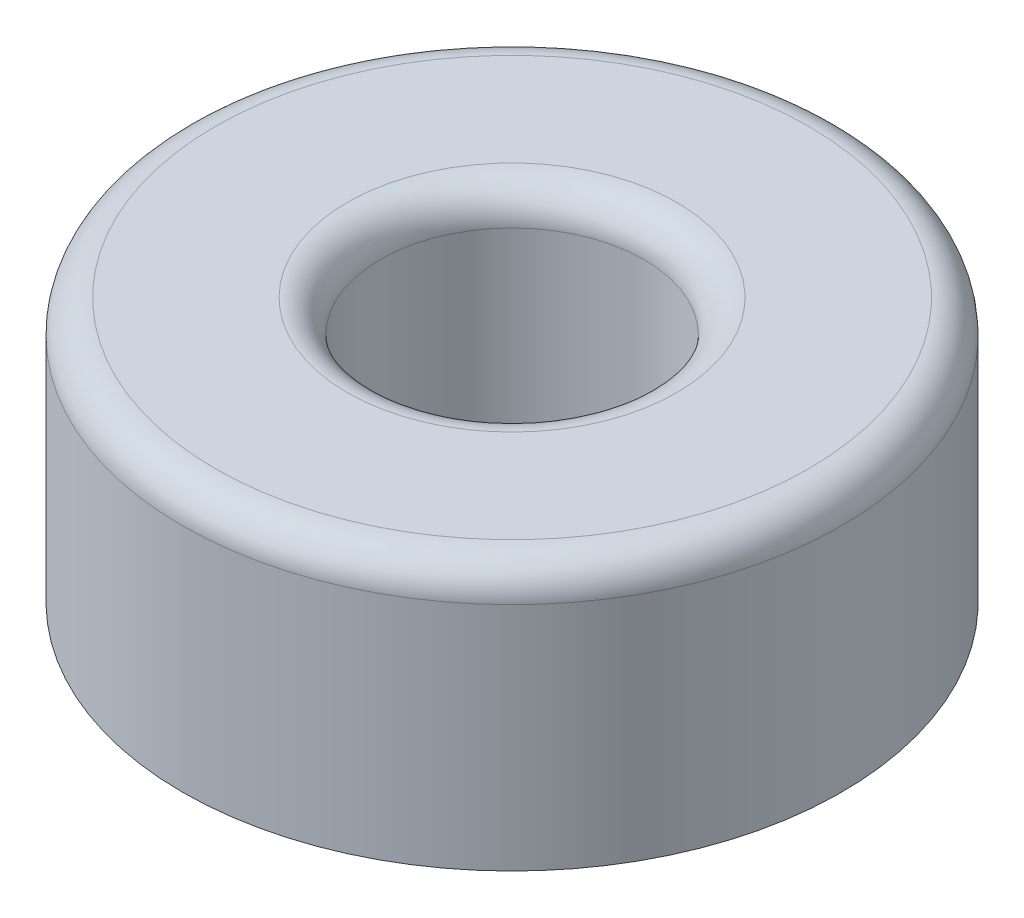
ISO-10303-21;
HEADER;
FILE_DESCRIPTION(('STEP AP214'),'2;1');
FILE_NAME('part.step','',(''),(''),'','','');
FILE_SCHEMA(('AUTOMOTIVE_DESIGN { 1 0 10303 214 1 1 1 1 }'));
ENDSEC;
DATA;
#1=APPLICATION_CONTEXT('core data for automotive mechanical design processes');
#2=APPLICATION_PROTOCOL_DEFINITION('international standard','automotive_design',2000,#1);
#3=PRODUCT_CONTEXT('',#1,'mechanical');
#4=PRODUCT('Part','Part','',(#3));
#5=PRODUCT_RELATED_PRODUCT_CATEGORY('part','',(#4));
#6=PRODUCT_DEFINITION_FORMATION('','',#4);
#7=PRODUCT_DEFINITION_CONTEXT('part definition',#1,'design');
#8=PRODUCT_DEFINITION('design','',#6,#7);
#9=PRODUCT_DEFINITION_SHAPE('','',#8);
#10=(LENGTH_UNIT() NAMED_UNIT(*) SI_UNIT(.MILLI.,.METRE.));
#11=(NAMED_UNIT(*) PLANE_ANGLE_UNIT() SI_UNIT($,.RADIAN.));
#12=(NAMED_UNIT(*) SI_UNIT($,.STERADIAN.) SOLID_ANGLE_UNIT());
#13=UNCERTAINTY_MEASURE_WITH_UNIT(LENGTH_MEASURE(1.E-05),#10,'distance_accuracy_value','');
#14=(GEOMETRIC_REPRESENTATION_CONTEXT(3) GLOBAL_UNCERTAINTY_ASSIGNED_CONTEXT((#13)) GLOBAL_UNIT_ASSIGNED_CONTEXT((#10,
#11,#12)) REPRESENTATION_CONTEXT('',''));
#15=CARTESIAN_POINT('',(0.,0.,0.));
#16=DIRECTION('',(0.,0.,1.));
#17=DIRECTION('',(1.,0.,0.));
#18=AXIS2_PLACEMENT_3D('',#15,#16,#17);
#19=CARTESIAN_POINT('',(0.,4.,0.));
#20=DIRECTION('',(0.,1.,0.));
#21=DIRECTION('',(0.,0.,1.));
#22=AXIS2_PLACEMENT_3D('',#19,#20,#21);
#23=PLANE('',#22);
#24=CARTESIAN_POINT('',(0.,4.,0.));
#25=DIRECTION('',(0.,1.,0.));
#26=DIRECTION('',(0.,0.,1.));
#27=AXIS2_PLACEMENT_3D('',#24,#25,#26);
#28=CIRCLE('',#27,2.5);
#29=CARTESIAN_POINT('',(0.,4.,2.5));
#30=VERTEX_POINT('',#29);
#31=EDGE_CURVE('E44',#30,#30,#28,.F.);
#32=ORIENTED_EDGE('',*,*,#31,.T.);
#33=EDGE_LOOP('',(#32));
#34=FACE_BOUND('',#33,.T.);
#35=CARTESIAN_POINT('',(0.,4.,0.));
#36=DIRECTION('',(0.,1.,0.));
#37=DIRECTION('',(0.,0.,1.));
#38=AXIS2_PLACEMENT_3D('',#35,#36,#37);
#39=CIRCLE('',#38,4.5);
#40=CARTESIAN_POINT('',(0.,4.,4.5));
#41=VERTEX_POINT('',#40);
#42=EDGE_CURVE('E48',#41,#41,#39,.T.);
#43=ORIENTED_EDGE('',*,*,#42,.T.);
#44=EDGE_LOOP('',(#43));
#45=FACE_BOUND('',#44,.T.);
#46=ADVANCED_FACE('F37',(#34,#45),#23,.T.);
#47=CARTESIAN_POINT('',(0.,0.,0.));
#48=DIRECTION('',(0.,1.,0.));
#49=DIRECTION('',(0.,0.,1.));
#50=AXIS2_PLACEMENT_3D('',#47,#48,#49);
#51=PLANE('',#50);
#52=CARTESIAN_POINT('',(0.,0.,0.));
#53=DIRECTION('',(0.,1.,0.));
#54=DIRECTION('',(0.,0.,1.));
#55=AXIS2_PLACEMENT_3D('',#52,#53,#54);
#56=CIRCLE('',#55,5.);
#57=CARTESIAN_POINT('',(0.,0.,5.));
#58=VERTEX_POINT('',#57);
#59=EDGE_CURVE('E57',#58,#58,#56,.T.);
#60=ORIENTED_EDGE('',*,*,#59,.F.);
#61=EDGE_LOOP('',(#60));
#62=FACE_BOUND('',#61,.T.);
#63=CARTESIAN_POINT('',(0.,0.,0.));
#64=DIRECTION('',(0.,1.,0.));
#65=DIRECTION('',(0.,0.,1.));
#66=AXIS2_PLACEMENT_3D('',#63,#64,#65);
#67=CIRCLE('',#66,2.);
#68=CARTESIAN_POINT('',(0.,0.,2.));
#69=VERTEX_POINT('',#68);
#70=EDGE_CURVE('E60',#69,#69,#67,.T.);
#71=ORIENTED_EDGE('',*,*,#70,.T.);
#72=EDGE_LOOP('',(#71));
#73=FACE_BOUND('',#72,.T.);
#74=ADVANCED_FACE('F64',(#62,#73),#51,.F.);
#75=CARTESIAN_POINT('',(0.,4.,0.));
#76=DIRECTION('',(0.,-1.,0.));
#77=DIRECTION('',(0.,0.,-1.));
#78=AXIS2_PLACEMENT_3D('',#75,#76,#77);
#79=CYLINDRICAL_SURFACE('',#78,5.);
#80=CARTESIAN_POINT('',(0.,3.5,0.));
#81=DIRECTION('',(0.,1.,0.));
#82=DIRECTION('',(0.,0.,1.));
#83=AXIS2_PLACEMENT_3D('',#80,#81,#82);
#84=CIRCLE('',#83,5.);
#85=CARTESIAN_POINT('',(0.,3.5,5.));
#86=VERTEX_POINT('',#85);
#87=EDGE_CURVE('E10',#86,#86,#84,.F.);
#88=ORIENTED_EDGE('',*,*,#87,.T.);
#89=EDGE_LOOP('',(#88));
#90=FACE_BOUND('',#89,.T.);
#91=ORIENTED_EDGE('',*,*,#59,.T.);
#92=EDGE_LOOP('',(#91));
#93=FACE_BOUND('',#92,.T.);
#94=ADVANCED_FACE('F69',(#90,#93),#79,.T.);
#95=CARTESIAN_POINT('',(0.,4.,0.));
#96=DIRECTION('',(0.,-1.,0.));
#97=DIRECTION('',(0.,0.,-1.));
#98=AXIS2_PLACEMENT_3D('',#95,#96,#97);
#99=CYLINDRICAL_SURFACE('',#98,2.);
#100=CARTESIAN_POINT('',(0.,3.5,0.));
#101=DIRECTION('',(0.,1.,0.));
#102=DIRECTION('',(0.,0.,1.));
#103=AXIS2_PLACEMENT_3D('',#100,#101,#102);
#104=CIRCLE('',#103,2.);
#105=CARTESIAN_POINT('',(0.,3.5,2.));
#106=VERTEX_POINT('',#105);
#107=EDGE_CURVE('E52',#106,#106,#104,.T.);
#108=ORIENTED_EDGE('',*,*,#107,.T.);
#109=EDGE_LOOP('',(#108));
#110=FACE_BOUND('',#109,.T.);
#111=ORIENTED_EDGE('',*,*,#70,.F.);
#112=EDGE_LOOP('',(#111));
#113=FACE_BOUND('',#112,.T.);
#114=ADVANCED_FACE('F66',(#110,#113),#99,.F.);
#115=CARTESIAN_POINT('',(0.,3.5,0.));
#116=DIRECTION('',(0.,1.,0.));
#117=DIRECTION('',(0.,0.,1.));
#118=AXIS2_PLACEMENT_3D('',#115,#116,#117);
#119=TOROIDAL_SURFACE('',#118,2.5,0.5);
#120=ORIENTED_EDGE('',*,*,#31,.F.);
#121=EDGE_LOOP('',(#120));
#122=FACE_BOUND('',#121,.T.);
#123=ORIENTED_EDGE('',*,*,#107,.F.);
#124=EDGE_LOOP('',(#123));
#125=FACE_BOUND('',#124,.T.);
#126=ADVANCED_FACE('F68',(#122,#125),#119,.T.);
#127=CARTESIAN_POINT('',(0.,3.5,0.));
#128=DIRECTION('',(0.,1.,0.));
#129=DIRECTION('',(0.,0.,1.));
#130=AXIS2_PLACEMENT_3D('',#127,#128,#129);
#131=TOROIDAL_SURFACE('',#130,4.5,0.5);
#132=ORIENTED_EDGE('',*,*,#87,.F.);
#133=EDGE_LOOP('',(#132));
#134=FACE_BOUND('',#133,.T.);
#135=ORIENTED_EDGE('',*,*,#42,.F.);
#136=EDGE_LOOP('',(#135));
#137=FACE_BOUND('',#136,.T.);
#138=ADVANCED_FACE('F39',(#134,#137),#131,.T.);
#139=CLOSED_SHELL('',(#46,#74,#94,#114,#126,#138));
#140=MANIFOLD_SOLID_BREP('B2',#139);
#141=ADVANCED_BREP_SHAPE_REPRESENTATION('',(#18,#140),#14);
#142=SHAPE_DEFINITION_REPRESENTATION(#9,#141);
ENDSEC;
END-ISO-10303-21;
